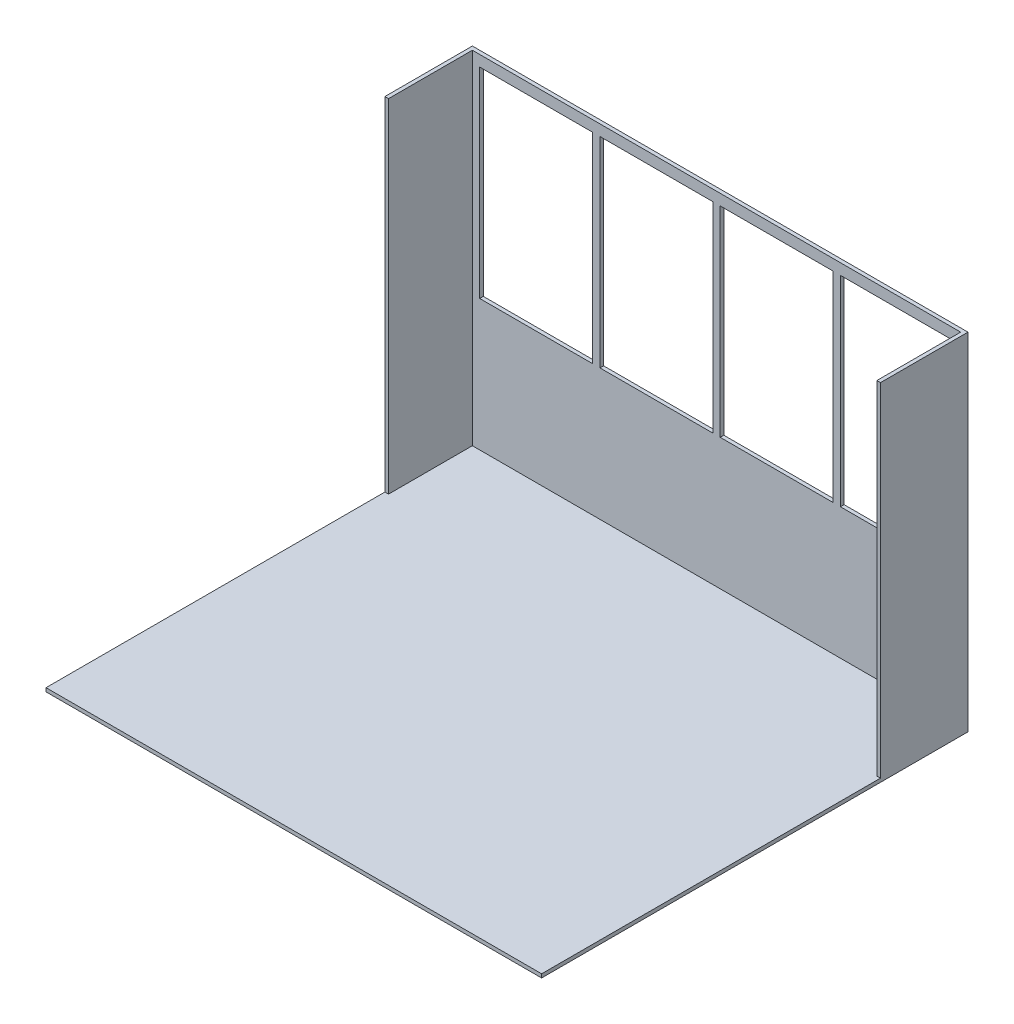
ISO-10303-21;
HEADER;
FILE_DESCRIPTION(('STEP AP214'),'2;1');
FILE_NAME('part.step','',(''),(''),'','','');
FILE_SCHEMA(('AUTOMOTIVE_DESIGN { 1 0 10303 214 1 1 1 1 }'));
ENDSEC;
DATA;
#1=APPLICATION_CONTEXT('core data for automotive mechanical design processes');
#2=APPLICATION_PROTOCOL_DEFINITION('international standard','automotive_design',2000,#1);
#3=PRODUCT_CONTEXT('',#1,'mechanical');
#4=PRODUCT('Part','Part','',(#3));
#5=PRODUCT_RELATED_PRODUCT_CATEGORY('part','',(#4));
#6=PRODUCT_DEFINITION_FORMATION('','',#4);
#7=PRODUCT_DEFINITION_CONTEXT('part definition',#1,'design');
#8=PRODUCT_DEFINITION('design','',#6,#7);
#9=PRODUCT_DEFINITION_SHAPE('','',#8);
#10=(LENGTH_UNIT() NAMED_UNIT(*) SI_UNIT(.MILLI.,.METRE.));
#11=(NAMED_UNIT(*) PLANE_ANGLE_UNIT() SI_UNIT($,.RADIAN.));
#12=(NAMED_UNIT(*) SI_UNIT($,.STERADIAN.) SOLID_ANGLE_UNIT());
#13=UNCERTAINTY_MEASURE_WITH_UNIT(LENGTH_MEASURE(1.E-05),#10,'distance_accuracy_value','');
#14=(GEOMETRIC_REPRESENTATION_CONTEXT(3) GLOBAL_UNCERTAINTY_ASSIGNED_CONTEXT((#13)) GLOBAL_UNIT_ASSIGNED_CONTEXT((#10,
#11,#12)) REPRESENTATION_CONTEXT('',''));
#15=CARTESIAN_POINT('',(0.,0.,0.));
#16=DIRECTION('',(0.,0.,1.));
#17=DIRECTION('',(1.,0.,0.));
#18=AXIS2_PLACEMENT_3D('',#15,#16,#17);
#19=CARTESIAN_POINT('',(-1727.2,2413.,304.8));
#20=DIRECTION('',(0.,0.,-1.));
#21=DIRECTION('',(-1.,0.,0.));
#22=AXIS2_PLACEMENT_3D('',#19,#20,#21);
#23=PLANE('',#22);
#24=DIRECTION('',(-1.,0.,0.));
#25=VECTOR('',#24,1.);
#26=CARTESIAN_POINT('',(-1727.2,25.4,304.8));
#27=LINE('',#26,#25);
#28=CARTESIAN_POINT('',(1727.2,25.3999999999999,304.8));
#29=VERTEX_POINT('',#28);
#30=CARTESIAN_POINT('',(1701.8,25.4,304.8));
#31=VERTEX_POINT('',#30);
#32=EDGE_CURVE('E43',#29,#31,#27,.T.);
#33=ORIENTED_EDGE('',*,*,#32,.F.);
#34=DIRECTION('',(0.,-1.,0.));
#35=VECTOR('',#34,1.);
#36=CARTESIAN_POINT('',(1727.2,2413.,304.8));
#37=LINE('',#36,#35);
#38=CARTESIAN_POINT('',(1727.2,2413.,304.8));
#39=VERTEX_POINT('',#38);
#40=EDGE_CURVE('E399',#39,#29,#37,.T.);
#41=ORIENTED_EDGE('',*,*,#40,.F.);
#42=DIRECTION('',(1.,0.,0.));
#43=VECTOR('',#42,1.);
#44=CARTESIAN_POINT('',(-1727.2,2413.,304.8));
#45=LINE('',#44,#43);
#46=CARTESIAN_POINT('',(1701.8,2413.,304.8));
#47=VERTEX_POINT('',#46);
#48=EDGE_CURVE('E395',#47,#39,#45,.T.);
#49=ORIENTED_EDGE('',*,*,#48,.F.);
#50=DIRECTION('',(0.,-1.,0.));
#51=VECTOR('',#50,1.);
#52=CARTESIAN_POINT('',(1701.8,2413.,304.8));
#53=LINE('',#52,#51);
#54=EDGE_CURVE('E382',#47,#31,#53,.T.);
#55=ORIENTED_EDGE('',*,*,#54,.T.);
#56=EDGE_LOOP('',(#33,#41,#49,#55));
#57=FACE_BOUND('',#56,.T.);
#58=ADVANCED_FACE('F33',(#57),#23,.F.);
#59=CARTESIAN_POINT('',(-1701.8,25.4,304.8));
#60=VERTEX_POINT('',#59);
#61=CARTESIAN_POINT('',(-1727.2,25.4,304.8));
#62=VERTEX_POINT('',#61);
#63=EDGE_CURVE('E11',#60,#62,#27,.T.);
#64=ORIENTED_EDGE('',*,*,#63,.F.);
#65=DIRECTION('',(0.,-1.,0.));
#66=VECTOR('',#65,1.);
#67=CARTESIAN_POINT('',(-1701.8,2413.,304.8));
#68=LINE('',#67,#66);
#69=CARTESIAN_POINT('',(-1701.8,2413.,304.8));
#70=VERTEX_POINT('',#69);
#71=EDGE_CURVE('E372',#70,#60,#68,.T.);
#72=ORIENTED_EDGE('',*,*,#71,.F.);
#73=CARTESIAN_POINT('',(-1727.2,2413.,304.8));
#74=VERTEX_POINT('',#73);
#75=EDGE_CURVE('E396',#74,#70,#45,.T.);
#76=ORIENTED_EDGE('',*,*,#75,.F.);
#77=DIRECTION('',(0.,-1.,0.));
#78=VECTOR('',#77,1.);
#79=CARTESIAN_POINT('',(-1727.2,2413.,304.8));
#80=LINE('',#79,#78);
#81=EDGE_CURVE('E407',#74,#62,#80,.T.);
#82=ORIENTED_EDGE('',*,*,#81,.T.);
#83=EDGE_LOOP('',(#64,#72,#76,#82));
#84=FACE_BOUND('',#83,.T.);
#85=ADVANCED_FACE('F437',(#84),#23,.F.);
#86=CARTESIAN_POINT('',(0.,2413.,0.));
#87=DIRECTION('',(0.,-1.,0.));
#88=DIRECTION('',(0.,0.,-1.));
#89=AXIS2_PLACEMENT_3D('',#86,#87,#88);
#90=PLANE('',#89);
#91=DIRECTION('',(0.,0.,-1.));
#92=VECTOR('',#91,1.);
#93=CARTESIAN_POINT('',(1701.8,2413.,0.));
#94=LINE('',#93,#92);
#95=CARTESIAN_POINT('',(1701.8,2413.,-279.4));
#96=VERTEX_POINT('',#95);
#97=EDGE_CURVE('E375',#47,#96,#94,.T.);
#98=ORIENTED_EDGE('',*,*,#97,.F.);
#99=ORIENTED_EDGE('',*,*,#48,.T.);
#100=DIRECTION('',(0.,0.,-1.));
#101=VECTOR('',#100,1.);
#102=CARTESIAN_POINT('',(1727.2,2413.,304.8));
#103=LINE('',#102,#101);
#104=CARTESIAN_POINT('',(1727.2,2413.,-304.8));
#105=VERTEX_POINT('',#104);
#106=EDGE_CURVE('E387',#39,#105,#103,.T.);
#107=ORIENTED_EDGE('',*,*,#106,.T.);
#108=DIRECTION('',(-1.,0.,0.));
#109=VECTOR('',#108,1.);
#110=CARTESIAN_POINT('',(-1727.2,2413.,-304.8));
#111=LINE('',#110,#109);
#112=CARTESIAN_POINT('',(-1727.2,2413.,-304.8));
#113=VERTEX_POINT('',#112);
#114=EDGE_CURVE('E390',#105,#113,#111,.T.);
#115=ORIENTED_EDGE('',*,*,#114,.T.);
#116=DIRECTION('',(0.,0.,1.));
#117=VECTOR('',#116,1.);
#118=CARTESIAN_POINT('',(-1727.2,2413.,304.8));
#119=LINE('',#118,#117);
#120=EDGE_CURVE('E393',#113,#74,#119,.T.);
#121=ORIENTED_EDGE('',*,*,#120,.T.);
#122=ORIENTED_EDGE('',*,*,#75,.T.);
#123=DIRECTION('',(0.,0.,1.));
#124=VECTOR('',#123,1.);
#125=CARTESIAN_POINT('',(-1701.8,2413.,0.));
#126=LINE('',#125,#124);
#127=CARTESIAN_POINT('',(-1701.8,2413.,-279.4));
#128=VERTEX_POINT('',#127);
#129=EDGE_CURVE('E380',#128,#70,#126,.T.);
#130=ORIENTED_EDGE('',*,*,#129,.F.);
#131=DIRECTION('',(-1.,0.,0.));
#132=VECTOR('',#131,1.);
#133=CARTESIAN_POINT('',(0.,2413.,-279.4));
#134=LINE('',#133,#132);
#135=EDGE_CURVE('E377',#96,#128,#134,.T.);
#136=ORIENTED_EDGE('',*,*,#135,.F.);
#137=EDGE_LOOP('',(#98,#99,#107,#115,#121,#122,#130,#136));
#138=FACE_BOUND('',#137,.T.);
#139=ADVANCED_FACE('F441',(#138),#90,.F.);
#140=CARTESIAN_POINT('',(1727.2,2413.,304.8));
#141=DIRECTION('',(-1.,0.,0.));
#142=DIRECTION('',(0.,0.,1.));
#143=AXIS2_PLACEMENT_3D('',#140,#141,#142);
#144=PLANE('',#143);
#145=DIRECTION('',(0.,0.,-1.));
#146=VECTOR('',#145,1.);
#147=CARTESIAN_POINT('',(1727.2,0.,304.8));
#148=LINE('',#147,#146);
#149=CARTESIAN_POINT('',(1727.2,0.,2667.));
#150=VERTEX_POINT('',#149);
#151=CARTESIAN_POINT('',(1727.2,0.,-304.8));
#152=VERTEX_POINT('',#151);
#153=EDGE_CURVE('E366',#150,#152,#148,.T.);
#154=ORIENTED_EDGE('',*,*,#153,.T.);
#155=DIRECTION('',(0.,-1.,0.));
#156=VECTOR('',#155,1.);
#157=CARTESIAN_POINT('',(1727.2,2413.,-304.8));
#158=LINE('',#157,#156);
#159=EDGE_CURVE('E37',#105,#152,#158,.T.);
#160=ORIENTED_EDGE('',*,*,#159,.F.);
#161=ORIENTED_EDGE('',*,*,#106,.F.);
#162=ORIENTED_EDGE('',*,*,#40,.T.);
#163=DIRECTION('',(0.,0.,-1.));
#164=VECTOR('',#163,1.);
#165=CARTESIAN_POINT('',(1727.2,25.3999999999999,2667.));
#166=LINE('',#165,#164);
#167=CARTESIAN_POINT('',(1727.2,25.3999999999999,2667.));
#168=VERTEX_POINT('',#167);
#169=EDGE_CURVE('E356',#168,#29,#166,.T.);
#170=ORIENTED_EDGE('',*,*,#169,.F.);
#171=DIRECTION('',(0.,1.,0.));
#172=VECTOR('',#171,1.);
#173=CARTESIAN_POINT('',(1727.2,0.,2667.));
#174=LINE('',#173,#172);
#175=EDGE_CURVE('E348',#150,#168,#174,.T.);
#176=ORIENTED_EDGE('',*,*,#175,.F.);
#177=EDGE_LOOP('',(#154,#160,#161,#162,#170,#176));
#178=FACE_BOUND('',#177,.T.);
#179=ADVANCED_FACE('F35',(#178),#144,.F.);
#180=CARTESIAN_POINT('',(-1727.2,2413.,-304.8));
#181=DIRECTION('',(0.,0.,1.));
#182=DIRECTION('',(1.,0.,0.));
#183=AXIS2_PLACEMENT_3D('',#180,#181,#182);
#184=PLANE('',#183);
#185=DIRECTION('',(1.,0.,0.));
#186=VECTOR('',#185,1.);
#187=CARTESIAN_POINT('',(-1651.,939.8,-304.8));
#188=LINE('',#187,#186);
#189=CARTESIAN_POINT('',(-1651.,939.8,-304.8));
#190=VERTEX_POINT('',#189);
#191=CARTESIAN_POINT('',(-863.600000000001,939.8,-304.8));
#192=VERTEX_POINT('',#191);
#193=EDGE_CURVE('E220',#190,#192,#188,.T.);
#194=ORIENTED_EDGE('',*,*,#193,.T.);
#195=DIRECTION('',(0.,1.,0.));
#196=VECTOR('',#195,1.);
#197=CARTESIAN_POINT('',(-863.600000000001,2336.8,-304.8));
#198=LINE('',#197,#196);
#199=CARTESIAN_POINT('',(-863.600000000001,2336.8,-304.8));
#200=VERTEX_POINT('',#199);
#201=EDGE_CURVE('E212',#192,#200,#198,.T.);
#202=ORIENTED_EDGE('',*,*,#201,.T.);
#203=DIRECTION('',(-1.,0.,0.));
#204=VECTOR('',#203,1.);
#205=CARTESIAN_POINT('',(-863.600000000001,2336.8,-304.8));
#206=LINE('',#205,#204);
#207=CARTESIAN_POINT('',(-1651.,2336.8,-304.8));
#208=VERTEX_POINT('',#207);
#209=EDGE_CURVE('E223',#200,#208,#206,.T.);
#210=ORIENTED_EDGE('',*,*,#209,.T.);
#211=DIRECTION('',(0.,-1.,0.));
#212=VECTOR('',#211,1.);
#213=CARTESIAN_POINT('',(-1651.,2336.8,-304.8));
#214=LINE('',#213,#212);
#215=EDGE_CURVE('E50',#208,#190,#214,.T.);
#216=ORIENTED_EDGE('',*,*,#215,.T.);
#217=EDGE_LOOP('',(#194,#202,#210,#216));
#218=FACE_BOUND('',#217,.T.);
#219=DIRECTION('',(-1.,0.,0.));
#220=VECTOR('',#219,1.);
#221=CARTESIAN_POINT('',(-812.800000000001,2336.8,-304.8));
#222=LINE('',#221,#220);
#223=CARTESIAN_POINT('',(-25.4000000000009,2336.8,-304.8));
#224=VERTEX_POINT('',#223);
#225=CARTESIAN_POINT('',(-812.800000000001,2336.8,-304.8));
#226=VERTEX_POINT('',#225);
#227=EDGE_CURVE('E257',#224,#226,#222,.T.);
#228=ORIENTED_EDGE('',*,*,#227,.T.);
#229=DIRECTION('',(0.,-1.,0.));
#230=VECTOR('',#229,1.);
#231=CARTESIAN_POINT('',(-812.800000000001,2336.8,-304.8));
#232=LINE('',#231,#230);
#233=CARTESIAN_POINT('',(-812.800000000001,939.8,-304.8));
#234=VERTEX_POINT('',#233);
#235=EDGE_CURVE('E249',#226,#234,#232,.T.);
#236=ORIENTED_EDGE('',*,*,#235,.T.);
#237=DIRECTION('',(1.,0.,0.));
#238=VECTOR('',#237,1.);
#239=CARTESIAN_POINT('',(-812.800000000001,939.8,-304.8));
#240=LINE('',#239,#238);
#241=CARTESIAN_POINT('',(-25.4000000000005,939.8,-304.8));
#242=VERTEX_POINT('',#241);
#243=EDGE_CURVE('E252',#234,#242,#240,.T.);
#244=ORIENTED_EDGE('',*,*,#243,.T.);
#245=DIRECTION('',(0.,1.,0.));
#246=VECTOR('',#245,1.);
#247=CARTESIAN_POINT('',(-25.4000000000009,2336.8,-304.8));
#248=LINE('',#247,#246);
#249=EDGE_CURVE('E58',#242,#224,#248,.T.);
#250=ORIENTED_EDGE('',*,*,#249,.T.);
#251=EDGE_LOOP('',(#228,#236,#244,#250));
#252=FACE_BOUND('',#251,.T.);
#253=DIRECTION('',(-1.,0.,0.));
#254=VECTOR('',#253,1.);
#255=CARTESIAN_POINT('',(25.3999999999991,2336.8,-304.8));
#256=LINE('',#255,#254);
#257=CARTESIAN_POINT('',(812.799999999999,2336.8,-304.8));
#258=VERTEX_POINT('',#257);
#259=CARTESIAN_POINT('',(25.3999999999991,2336.8,-304.8));
#260=VERTEX_POINT('',#259);
#261=EDGE_CURVE('E289',#258,#260,#256,.T.);
#262=ORIENTED_EDGE('',*,*,#261,.T.);
#263=DIRECTION('',(0.,-1.,0.));
#264=VECTOR('',#263,1.);
#265=CARTESIAN_POINT('',(25.3999999999991,939.8,-304.8));
#266=LINE('',#265,#264);
#267=CARTESIAN_POINT('',(25.3999999999991,939.8,-304.8));
#268=VERTEX_POINT('',#267);
#269=EDGE_CURVE('E279',#260,#268,#266,.T.);
#270=ORIENTED_EDGE('',*,*,#269,.T.);
#271=DIRECTION('',(1.,0.,0.));
#272=VECTOR('',#271,1.);
#273=CARTESIAN_POINT('',(25.3999999999991,939.8,-304.8));
#274=LINE('',#273,#272);
#275=CARTESIAN_POINT('',(812.799999999999,939.8,-304.8));
#276=VERTEX_POINT('',#275);
#277=EDGE_CURVE('E282',#268,#276,#274,.T.);
#278=ORIENTED_EDGE('',*,*,#277,.T.);
#279=DIRECTION('',(0.,1.,0.));
#280=VECTOR('',#279,1.);
#281=CARTESIAN_POINT('',(812.799999999999,939.8,-304.8));
#282=LINE('',#281,#280);
#283=EDGE_CURVE('E286',#276,#258,#282,.T.);
#284=ORIENTED_EDGE('',*,*,#283,.T.);
#285=EDGE_LOOP('',(#262,#270,#278,#284));
#286=FACE_BOUND('',#285,.T.);
#287=DIRECTION('',(-1.,0.,0.));
#288=VECTOR('',#287,1.);
#289=CARTESIAN_POINT('',(863.599999999999,2336.8,-304.8));
#290=LINE('',#289,#288);
#291=CARTESIAN_POINT('',(1651.,2336.8,-304.8));
#292=VERTEX_POINT('',#291);
#293=CARTESIAN_POINT('',(863.599999999999,2336.8,-304.8));
#294=VERTEX_POINT('',#293);
#295=EDGE_CURVE('E321',#292,#294,#290,.T.);
#296=ORIENTED_EDGE('',*,*,#295,.T.);
#297=DIRECTION('',(0.,-1.,0.));
#298=VECTOR('',#297,1.);
#299=CARTESIAN_POINT('',(863.599999999999,2336.8,-304.8));
#300=LINE('',#299,#298);
#301=CARTESIAN_POINT('',(863.599999999999,939.8,-304.8));
#302=VERTEX_POINT('',#301);
#303=EDGE_CURVE('E311',#294,#302,#300,.T.);
#304=ORIENTED_EDGE('',*,*,#303,.T.);
#305=DIRECTION('',(1.,0.,0.));
#306=VECTOR('',#305,1.);
#307=CARTESIAN_POINT('',(863.599999999999,939.8,-304.8));
#308=LINE('',#307,#306);
#309=CARTESIAN_POINT('',(1651.,939.799999999999,-304.8));
#310=VERTEX_POINT('',#309);
#311=EDGE_CURVE('E314',#302,#310,#308,.T.);
#312=ORIENTED_EDGE('',*,*,#311,.T.);
#313=DIRECTION('',(0.,1.,0.));
#314=VECTOR('',#313,1.);
#315=CARTESIAN_POINT('',(1651.,2336.8,-304.8));
#316=LINE('',#315,#314);
#317=EDGE_CURVE('E318',#310,#292,#316,.T.);
#318=ORIENTED_EDGE('',*,*,#317,.T.);
#319=EDGE_LOOP('',(#296,#304,#312,#318));
#320=FACE_BOUND('',#319,.T.);
#321=DIRECTION('',(-1.,0.,0.));
#322=VECTOR('',#321,1.);
#323=CARTESIAN_POINT('',(-1727.2,0.,-304.8));
#324=LINE('',#323,#322);
#325=CARTESIAN_POINT('',(-1727.2,0.,-304.8));
#326=VERTEX_POINT('',#325);
#327=EDGE_CURVE('E402',#152,#326,#324,.T.);
#328=ORIENTED_EDGE('',*,*,#327,.T.);
#329=DIRECTION('',(0.,-1.,0.));
#330=VECTOR('',#329,1.);
#331=CARTESIAN_POINT('',(-1727.2,2413.,-304.8));
#332=LINE('',#331,#330);
#333=EDGE_CURVE('E408',#113,#326,#332,.T.);
#334=ORIENTED_EDGE('',*,*,#333,.F.);
#335=ORIENTED_EDGE('',*,*,#114,.F.);
#336=ORIENTED_EDGE('',*,*,#159,.T.);
#337=EDGE_LOOP('',(#328,#334,#335,#336));
#338=FACE_BOUND('',#337,.T.);
#339=ADVANCED_FACE('F227',(#218,#252,#286,#320,#338),#184,.F.);
#340=CARTESIAN_POINT('',(-1727.2,2413.,304.8));
#341=DIRECTION('',(1.,0.,0.));
#342=DIRECTION('',(0.,0.,-1.));
#343=AXIS2_PLACEMENT_3D('',#340,#341,#342);
#344=PLANE('',#343);
#345=DIRECTION('',(0.,0.,1.));
#346=VECTOR('',#345,1.);
#347=CARTESIAN_POINT('',(-1727.2,0.,304.8));
#348=LINE('',#347,#346);
#349=CARTESIAN_POINT('',(-1727.2,0.,2667.));
#350=VERTEX_POINT('',#349);
#351=EDGE_CURVE('E391',#326,#350,#348,.T.);
#352=ORIENTED_EDGE('',*,*,#351,.T.);
#353=DIRECTION('',(0.,-1.,0.));
#354=VECTOR('',#353,1.);
#355=CARTESIAN_POINT('',(-1727.2,0.,2667.));
#356=LINE('',#355,#354);
#357=CARTESIAN_POINT('',(-1727.2,25.4,2667.));
#358=VERTEX_POINT('',#357);
#359=EDGE_CURVE('E342',#358,#350,#356,.T.);
#360=ORIENTED_EDGE('',*,*,#359,.F.);
#361=DIRECTION('',(0.,0.,-1.));
#362=VECTOR('',#361,1.);
#363=CARTESIAN_POINT('',(-1727.2,25.4,2667.));
#364=LINE('',#363,#362);
#365=EDGE_CURVE('E351',#358,#62,#364,.T.);
#366=ORIENTED_EDGE('',*,*,#365,.T.);
#367=ORIENTED_EDGE('',*,*,#81,.F.);
#368=ORIENTED_EDGE('',*,*,#120,.F.);
#369=ORIENTED_EDGE('',*,*,#333,.T.);
#370=EDGE_LOOP('',(#352,#360,#366,#367,#368,#369));
#371=FACE_BOUND('',#370,.T.);
#372=ADVANCED_FACE('F429',(#371),#344,.F.);
#373=CARTESIAN_POINT('',(0.,0.,0.));
#374=DIRECTION('',(0.,-1.,0.));
#375=DIRECTION('',(0.,0.,-1.));
#376=AXIS2_PLACEMENT_3D('',#373,#374,#375);
#377=PLANE('',#376);
#378=ORIENTED_EDGE('',*,*,#153,.F.);
#379=DIRECTION('',(1.,0.,0.));
#380=VECTOR('',#379,1.);
#381=CARTESIAN_POINT('',(-1727.2,0.,2667.));
#382=LINE('',#381,#380);
#383=EDGE_CURVE('E345',#350,#150,#382,.T.);
#384=ORIENTED_EDGE('',*,*,#383,.F.);
#385=ORIENTED_EDGE('',*,*,#351,.F.);
#386=ORIENTED_EDGE('',*,*,#327,.F.);
#387=EDGE_LOOP('',(#378,#384,#385,#386));
#388=FACE_BOUND('',#387,.T.);
#389=ADVANCED_FACE('F423',(#388),#377,.T.);
#390=CARTESIAN_POINT('',(1701.8,2413.,304.8));
#391=DIRECTION('',(-1.,0.,0.));
#392=DIRECTION('',(0.,0.,1.));
#393=AXIS2_PLACEMENT_3D('',#390,#391,#392);
#394=PLANE('',#393);
#395=DIRECTION('',(0.,0.,-1.));
#396=VECTOR('',#395,1.);
#397=CARTESIAN_POINT('',(1701.8,25.4,0.));
#398=LINE('',#397,#396);
#399=CARTESIAN_POINT('',(1701.8,25.4,-279.4));
#400=VERTEX_POINT('',#399);
#401=EDGE_CURVE('E359',#31,#400,#398,.T.);
#402=ORIENTED_EDGE('',*,*,#401,.F.);
#403=ORIENTED_EDGE('',*,*,#54,.F.);
#404=ORIENTED_EDGE('',*,*,#97,.T.);
#405=DIRECTION('',(0.,-1.,0.));
#406=VECTOR('',#405,1.);
#407=CARTESIAN_POINT('',(1701.8,2413.,-279.4));
#408=LINE('',#407,#406);
#409=EDGE_CURVE('E363',#96,#400,#408,.T.);
#410=ORIENTED_EDGE('',*,*,#409,.T.);
#411=EDGE_LOOP('',(#402,#403,#404,#410));
#412=FACE_BOUND('',#411,.T.);
#413=ADVANCED_FACE('F447',(#412),#394,.T.);
#414=CARTESIAN_POINT('',(-1727.2,2413.,-279.4));
#415=DIRECTION('',(0.,0.,1.));
#416=DIRECTION('',(1.,0.,0.));
#417=AXIS2_PLACEMENT_3D('',#414,#415,#416);
#418=PLANE('',#417);
#419=DIRECTION('',(0.,1.,0.));
#420=VECTOR('',#419,1.);
#421=CARTESIAN_POINT('',(-863.600000000001,2336.8,-279.4));
#422=LINE('',#421,#420);
#423=CARTESIAN_POINT('',(-863.600000000001,939.8,-279.4));
#424=VERTEX_POINT('',#423);
#425=CARTESIAN_POINT('',(-863.600000000001,2336.8,-279.4));
#426=VERTEX_POINT('',#425);
#427=EDGE_CURVE('E215',#424,#426,#422,.T.);
#428=ORIENTED_EDGE('',*,*,#427,.F.);
#429=DIRECTION('',(1.,0.,0.));
#430=VECTOR('',#429,1.);
#431=CARTESIAN_POINT('',(-1651.,939.8,-279.4));
#432=LINE('',#431,#430);
#433=CARTESIAN_POINT('',(-1651.,939.8,-279.4));
#434=VERTEX_POINT('',#433);
#435=EDGE_CURVE('E230',#434,#424,#432,.T.);
#436=ORIENTED_EDGE('',*,*,#435,.F.);
#437=DIRECTION('',(0.,-1.,0.));
#438=VECTOR('',#437,1.);
#439=CARTESIAN_POINT('',(-1651.,2336.8,-279.4));
#440=LINE('',#439,#438);
#441=CARTESIAN_POINT('',(-1651.,2336.8,-279.4));
#442=VERTEX_POINT('',#441);
#443=EDGE_CURVE('E233',#442,#434,#440,.T.);
#444=ORIENTED_EDGE('',*,*,#443,.F.);
#445=DIRECTION('',(-1.,0.,0.));
#446=VECTOR('',#445,1.);
#447=CARTESIAN_POINT('',(-863.600000000001,2336.8,-279.4));
#448=LINE('',#447,#446);
#449=EDGE_CURVE('E239',#426,#442,#448,.T.);
#450=ORIENTED_EDGE('',*,*,#449,.F.);
#451=EDGE_LOOP('',(#428,#436,#444,#450));
#452=FACE_BOUND('',#451,.T.);
#453=DIRECTION('',(0.,-1.,0.));
#454=VECTOR('',#453,1.);
#455=CARTESIAN_POINT('',(-812.800000000001,2336.8,-279.4));
#456=LINE('',#455,#454);
#457=CARTESIAN_POINT('',(-812.800000000001,2336.8,-279.4));
#458=VERTEX_POINT('',#457);
#459=CARTESIAN_POINT('',(-812.800000000001,939.8,-279.4));
#460=VERTEX_POINT('',#459);
#461=EDGE_CURVE('E261',#458,#460,#456,.T.);
#462=ORIENTED_EDGE('',*,*,#461,.F.);
#463=DIRECTION('',(-1.,0.,0.));
#464=VECTOR('',#463,1.);
#465=CARTESIAN_POINT('',(-812.800000000001,2336.8,-279.4));
#466=LINE('',#465,#464);
#467=CARTESIAN_POINT('',(-25.4000000000009,2336.8,-279.4));
#468=VERTEX_POINT('',#467);
#469=EDGE_CURVE('E253',#468,#458,#466,.T.);
#470=ORIENTED_EDGE('',*,*,#469,.F.);
#471=DIRECTION('',(0.,1.,0.));
#472=VECTOR('',#471,1.);
#473=CARTESIAN_POINT('',(-25.4000000000009,2336.8,-279.4));
#474=LINE('',#473,#472);
#475=CARTESIAN_POINT('',(-25.4000000000007,939.8,-279.4));
#476=VERTEX_POINT('',#475);
#477=EDGE_CURVE('E267',#476,#468,#474,.T.);
#478=ORIENTED_EDGE('',*,*,#477,.F.);
#479=DIRECTION('',(1.,0.,0.));
#480=VECTOR('',#479,1.);
#481=CARTESIAN_POINT('',(-812.800000000001,939.8,-279.4));
#482=LINE('',#481,#480);
#483=EDGE_CURVE('E263',#460,#476,#482,.T.);
#484=ORIENTED_EDGE('',*,*,#483,.F.);
#485=EDGE_LOOP('',(#462,#470,#478,#484));
#486=FACE_BOUND('',#485,.T.);
#487=DIRECTION('',(0.,-1.,0.));
#488=VECTOR('',#487,1.);
#489=CARTESIAN_POINT('',(25.3999999999991,939.8,-279.4));
#490=LINE('',#489,#488);
#491=CARTESIAN_POINT('',(25.3999999999991,2336.8,-279.4));
#492=VERTEX_POINT('',#491);
#493=CARTESIAN_POINT('',(25.399999999999,939.8,-279.4));
#494=VERTEX_POINT('',#493);
#495=EDGE_CURVE('E293',#492,#494,#490,.T.);
#496=ORIENTED_EDGE('',*,*,#495,.F.);
#497=DIRECTION('',(-1.,0.,0.));
#498=VECTOR('',#497,1.);
#499=CARTESIAN_POINT('',(25.3999999999991,2336.8,-279.4));
#500=LINE('',#499,#498);
#501=CARTESIAN_POINT('',(812.799999999999,2336.8,-279.4));
#502=VERTEX_POINT('',#501);
#503=EDGE_CURVE('E283',#502,#492,#500,.T.);
#504=ORIENTED_EDGE('',*,*,#503,.F.);
#505=DIRECTION('',(0.,1.,0.));
#506=VECTOR('',#505,1.);
#507=CARTESIAN_POINT('',(812.799999999999,939.8,-279.4));
#508=LINE('',#507,#506);
#509=CARTESIAN_POINT('',(812.799999999999,939.8,-279.4));
#510=VERTEX_POINT('',#509);
#511=EDGE_CURVE('E299',#510,#502,#508,.T.);
#512=ORIENTED_EDGE('',*,*,#511,.F.);
#513=DIRECTION('',(1.,0.,0.));
#514=VECTOR('',#513,1.);
#515=CARTESIAN_POINT('',(25.3999999999991,939.8,-279.4));
#516=LINE('',#515,#514);
#517=EDGE_CURVE('E295',#494,#510,#516,.T.);
#518=ORIENTED_EDGE('',*,*,#517,.F.);
#519=EDGE_LOOP('',(#496,#504,#512,#518));
#520=FACE_BOUND('',#519,.T.);
#521=DIRECTION('',(0.,-1.,0.));
#522=VECTOR('',#521,1.);
#523=CARTESIAN_POINT('',(863.599999999999,2336.8,-279.4));
#524=LINE('',#523,#522);
#525=CARTESIAN_POINT('',(863.599999999999,2336.8,-279.4));
#526=VERTEX_POINT('',#525);
#527=CARTESIAN_POINT('',(863.599999999999,939.799999999999,-279.4));
#528=VERTEX_POINT('',#527);
#529=EDGE_CURVE('E325',#526,#528,#524,.T.);
#530=ORIENTED_EDGE('',*,*,#529,.F.);
#531=DIRECTION('',(-1.,0.,0.));
#532=VECTOR('',#531,1.);
#533=CARTESIAN_POINT('',(863.599999999999,2336.8,-279.4));
#534=LINE('',#533,#532);
#535=CARTESIAN_POINT('',(1651.,2336.8,-279.4));
#536=VERTEX_POINT('',#535);
#537=EDGE_CURVE('E315',#536,#526,#534,.T.);
#538=ORIENTED_EDGE('',*,*,#537,.F.);
#539=DIRECTION('',(0.,1.,0.));
#540=VECTOR('',#539,1.);
#541=CARTESIAN_POINT('',(1651.,2336.8,-279.4));
#542=LINE('',#541,#540);
#543=CARTESIAN_POINT('',(1651.,939.8,-279.4));
#544=VERTEX_POINT('',#543);
#545=EDGE_CURVE('E330',#544,#536,#542,.T.);
#546=ORIENTED_EDGE('',*,*,#545,.F.);
#547=DIRECTION('',(1.,0.,0.));
#548=VECTOR('',#547,1.);
#549=CARTESIAN_POINT('',(863.599999999999,939.8,-279.4));
#550=LINE('',#549,#548);
#551=EDGE_CURVE('E327',#528,#544,#550,.T.);
#552=ORIENTED_EDGE('',*,*,#551,.F.);
#553=EDGE_LOOP('',(#530,#538,#546,#552));
#554=FACE_BOUND('',#553,.T.);
#555=DIRECTION('',(-1.,0.,0.));
#556=VECTOR('',#555,1.);
#557=CARTESIAN_POINT('',(0.,25.4,-279.4));
#558=LINE('',#557,#556);
#559=CARTESIAN_POINT('',(-1701.8,25.4,-279.4));
#560=VERTEX_POINT('',#559);
#561=EDGE_CURVE('E362',#400,#560,#558,.T.);
#562=ORIENTED_EDGE('',*,*,#561,.F.);
#563=ORIENTED_EDGE('',*,*,#409,.F.);
#564=ORIENTED_EDGE('',*,*,#135,.T.);
#565=DIRECTION('',(0.,-1.,0.));
#566=VECTOR('',#565,1.);
#567=CARTESIAN_POINT('',(-1701.8,2413.,-279.4));
#568=LINE('',#567,#566);
#569=EDGE_CURVE('E367',#128,#560,#568,.T.);
#570=ORIENTED_EDGE('',*,*,#569,.T.);
#571=EDGE_LOOP('',(#562,#563,#564,#570));
#572=FACE_BOUND('',#571,.T.);
#573=ADVANCED_FACE('F450',(#452,#486,#520,#554,#572),#418,.T.);
#574=CARTESIAN_POINT('',(-1701.8,2413.,304.8));
#575=DIRECTION('',(1.,0.,0.));
#576=DIRECTION('',(0.,0.,-1.));
#577=AXIS2_PLACEMENT_3D('',#574,#575,#576);
#578=PLANE('',#577);
#579=DIRECTION('',(0.,0.,1.));
#580=VECTOR('',#579,1.);
#581=CARTESIAN_POINT('',(-1701.8,25.4,0.));
#582=LINE('',#581,#580);
#583=EDGE_CURVE('E369',#560,#60,#582,.T.);
#584=ORIENTED_EDGE('',*,*,#583,.F.);
#585=ORIENTED_EDGE('',*,*,#569,.F.);
#586=ORIENTED_EDGE('',*,*,#129,.T.);
#587=ORIENTED_EDGE('',*,*,#71,.T.);
#588=EDGE_LOOP('',(#584,#585,#586,#587));
#589=FACE_BOUND('',#588,.T.);
#590=ADVANCED_FACE('F452',(#589),#578,.T.);
#591=CARTESIAN_POINT('',(0.,25.4,0.));
#592=DIRECTION('',(0.,-1.,0.));
#593=DIRECTION('',(0.,0.,-1.));
#594=AXIS2_PLACEMENT_3D('',#591,#592,#593);
#595=PLANE('',#594);
#596=ORIENTED_EDGE('',*,*,#401,.T.);
#597=ORIENTED_EDGE('',*,*,#561,.T.);
#598=ORIENTED_EDGE('',*,*,#583,.T.);
#599=ORIENTED_EDGE('',*,*,#63,.T.);
#600=ORIENTED_EDGE('',*,*,#365,.F.);
#601=DIRECTION('',(-1.,0.,0.));
#602=VECTOR('',#601,1.);
#603=CARTESIAN_POINT('',(-1727.2,25.4,2667.));
#604=LINE('',#603,#602);
#605=EDGE_CURVE('E350',#168,#358,#604,.T.);
#606=ORIENTED_EDGE('',*,*,#605,.F.);
#607=ORIENTED_EDGE('',*,*,#169,.T.);
#608=ORIENTED_EDGE('',*,*,#32,.T.);
#609=EDGE_LOOP('',(#596,#597,#598,#599,#600,#606,#607,#608));
#610=FACE_BOUND('',#609,.T.);
#611=ADVANCED_FACE('F433',(#610),#595,.F.);
#612=CARTESIAN_POINT('',(0.,0.,2667.));
#613=DIRECTION('',(0.,0.,-1.));
#614=DIRECTION('',(-1.,0.,0.));
#615=AXIS2_PLACEMENT_3D('',#612,#613,#614);
#616=PLANE('',#615);
#617=ORIENTED_EDGE('',*,*,#359,.T.);
#618=ORIENTED_EDGE('',*,*,#383,.T.);
#619=ORIENTED_EDGE('',*,*,#175,.T.);
#620=ORIENTED_EDGE('',*,*,#605,.T.);
#621=EDGE_LOOP('',(#617,#618,#619,#620));
#622=FACE_BOUND('',#621,.T.);
#623=ADVANCED_FACE('F425',(#622),#616,.F.);
#624=CARTESIAN_POINT('',(863.599999999999,2336.8,-304.8));
#625=DIRECTION('',(-1.,0.,0.));
#626=DIRECTION('',(0.,-1.,0.));
#627=AXIS2_PLACEMENT_3D('',#624,#625,#626);
#628=PLANE('',#627);
#629=ORIENTED_EDGE('',*,*,#529,.T.);
#630=DIRECTION('',(0.,0.,1.));
#631=VECTOR('',#630,1.);
#632=CARTESIAN_POINT('',(863.599999999999,939.8,-304.8));
#633=LINE('',#632,#631);
#634=EDGE_CURVE('E324',#302,#528,#633,.T.);
#635=ORIENTED_EDGE('',*,*,#634,.F.);
#636=ORIENTED_EDGE('',*,*,#303,.F.);
#637=DIRECTION('',(0.,0.,1.));
#638=VECTOR('',#637,1.);
#639=CARTESIAN_POINT('',(863.599999999999,2336.8,-304.8));
#640=LINE('',#639,#638);
#641=EDGE_CURVE('E296',#294,#526,#640,.T.);
#642=ORIENTED_EDGE('',*,*,#641,.T.);
#643=EDGE_LOOP('',(#629,#635,#636,#642));
#644=FACE_BOUND('',#643,.T.);
#645=ADVANCED_FACE('F534',(#644),#628,.F.);
#646=CARTESIAN_POINT('',(863.599999999999,2336.8,-304.8));
#647=DIRECTION('',(0.,1.,0.));
#648=DIRECTION('',(0.,0.,1.));
#649=AXIS2_PLACEMENT_3D('',#646,#647,#648);
#650=PLANE('',#649);
#651=ORIENTED_EDGE('',*,*,#537,.T.);
#652=ORIENTED_EDGE('',*,*,#641,.F.);
#653=ORIENTED_EDGE('',*,*,#295,.F.);
#654=DIRECTION('',(0.,0.,1.));
#655=VECTOR('',#654,1.);
#656=CARTESIAN_POINT('',(1651.,2336.8,-304.8));
#657=LINE('',#656,#655);
#658=EDGE_CURVE('E336',#292,#536,#657,.T.);
#659=ORIENTED_EDGE('',*,*,#658,.T.);
#660=EDGE_LOOP('',(#651,#652,#653,#659));
#661=FACE_BOUND('',#660,.T.);
#662=ADVANCED_FACE('F553',(#661),#650,.F.);
#663=CARTESIAN_POINT('',(1651.,2336.8,-304.8));
#664=DIRECTION('',(1.,0.,0.));
#665=DIRECTION('',(0.,1.,0.));
#666=AXIS2_PLACEMENT_3D('',#663,#664,#665);
#667=PLANE('',#666);
#668=ORIENTED_EDGE('',*,*,#545,.T.);
#669=ORIENTED_EDGE('',*,*,#658,.F.);
#670=ORIENTED_EDGE('',*,*,#317,.F.);
#671=DIRECTION('',(0.,0.,1.));
#672=VECTOR('',#671,1.);
#673=CARTESIAN_POINT('',(1651.,939.8,-304.8));
#674=LINE('',#673,#672);
#675=EDGE_CURVE('E338',#310,#544,#674,.T.);
#676=ORIENTED_EDGE('',*,*,#675,.T.);
#677=EDGE_LOOP('',(#668,#669,#670,#676));
#678=FACE_BOUND('',#677,.T.);
#679=ADVANCED_FACE('F563',(#678),#667,.F.);
#680=CARTESIAN_POINT('',(863.599999999999,939.8,-304.8));
#681=DIRECTION('',(0.,-1.,0.));
#682=DIRECTION('',(1.,0.,0.));
#683=AXIS2_PLACEMENT_3D('',#680,#681,#682);
#684=PLANE('',#683);
#685=ORIENTED_EDGE('',*,*,#551,.T.);
#686=ORIENTED_EDGE('',*,*,#675,.F.);
#687=ORIENTED_EDGE('',*,*,#311,.F.);
#688=ORIENTED_EDGE('',*,*,#634,.T.);
#689=EDGE_LOOP('',(#685,#686,#687,#688));
#690=FACE_BOUND('',#689,.T.);
#691=ADVANCED_FACE('F573',(#690),#684,.F.);
#692=CARTESIAN_POINT('',(25.3999999999991,939.8,-304.8));
#693=DIRECTION('',(-1.,0.,0.));
#694=DIRECTION('',(0.,0.,1.));
#695=AXIS2_PLACEMENT_3D('',#692,#693,#694);
#696=PLANE('',#695);
#697=ORIENTED_EDGE('',*,*,#495,.T.);
#698=DIRECTION('',(0.,0.,1.));
#699=VECTOR('',#698,1.);
#700=CARTESIAN_POINT('',(25.3999999999991,939.8,-304.8));
#701=LINE('',#700,#699);
#702=EDGE_CURVE('E292',#268,#494,#701,.T.);
#703=ORIENTED_EDGE('',*,*,#702,.F.);
#704=ORIENTED_EDGE('',*,*,#269,.F.);
#705=DIRECTION('',(0.,0.,1.));
#706=VECTOR('',#705,1.);
#707=CARTESIAN_POINT('',(25.3999999999991,2336.8,-304.8));
#708=LINE('',#707,#706);
#709=EDGE_CURVE('E264',#260,#492,#708,.T.);
#710=ORIENTED_EDGE('',*,*,#709,.T.);
#711=EDGE_LOOP('',(#697,#703,#704,#710));
#712=FACE_BOUND('',#711,.T.);
#713=ADVANCED_FACE('F583',(#712),#696,.F.);
#714=CARTESIAN_POINT('',(25.3999999999991,2336.8,-304.8));
#715=DIRECTION('',(0.,1.,0.));
#716=DIRECTION('',(0.,0.,1.));
#717=AXIS2_PLACEMENT_3D('',#714,#715,#716);
#718=PLANE('',#717);
#719=ORIENTED_EDGE('',*,*,#503,.T.);
#720=ORIENTED_EDGE('',*,*,#709,.F.);
#721=ORIENTED_EDGE('',*,*,#261,.F.);
#722=DIRECTION('',(0.,0.,1.));
#723=VECTOR('',#722,1.);
#724=CARTESIAN_POINT('',(812.799999999999,2336.8,-304.8));
#725=LINE('',#724,#723);
#726=EDGE_CURVE('E305',#258,#502,#725,.T.);
#727=ORIENTED_EDGE('',*,*,#726,.T.);
#728=EDGE_LOOP('',(#719,#720,#721,#727));
#729=FACE_BOUND('',#728,.T.);
#730=ADVANCED_FACE('F593',(#729),#718,.F.);
#731=CARTESIAN_POINT('',(812.799999999999,939.8,-304.8));
#732=DIRECTION('',(1.,0.,0.));
#733=DIRECTION('',(0.,0.,-1.));
#734=AXIS2_PLACEMENT_3D('',#731,#732,#733);
#735=PLANE('',#734);
#736=ORIENTED_EDGE('',*,*,#511,.T.);
#737=ORIENTED_EDGE('',*,*,#726,.F.);
#738=ORIENTED_EDGE('',*,*,#283,.F.);
#739=DIRECTION('',(0.,0.,1.));
#740=VECTOR('',#739,1.);
#741=CARTESIAN_POINT('',(812.799999999999,939.8,-304.8));
#742=LINE('',#741,#740);
#743=EDGE_CURVE('E307',#276,#510,#742,.T.);
#744=ORIENTED_EDGE('',*,*,#743,.T.);
#745=EDGE_LOOP('',(#736,#737,#738,#744));
#746=FACE_BOUND('',#745,.T.);
#747=ADVANCED_FACE('F603',(#746),#735,.F.);
#748=CARTESIAN_POINT('',(25.3999999999991,939.8,-304.8));
#749=DIRECTION('',(0.,-1.,0.));
#750=DIRECTION('',(0.,0.,-1.));
#751=AXIS2_PLACEMENT_3D('',#748,#749,#750);
#752=PLANE('',#751);
#753=ORIENTED_EDGE('',*,*,#517,.T.);
#754=ORIENTED_EDGE('',*,*,#743,.F.);
#755=ORIENTED_EDGE('',*,*,#277,.F.);
#756=ORIENTED_EDGE('',*,*,#702,.T.);
#757=EDGE_LOOP('',(#753,#754,#755,#756));
#758=FACE_BOUND('',#757,.T.);
#759=ADVANCED_FACE('F613',(#758),#752,.F.);
#760=CARTESIAN_POINT('',(-812.800000000001,2336.8,-304.8));
#761=DIRECTION('',(-1.,0.,0.));
#762=DIRECTION('',(0.,-1.,0.));
#763=AXIS2_PLACEMENT_3D('',#760,#761,#762);
#764=PLANE('',#763);
#765=ORIENTED_EDGE('',*,*,#461,.T.);
#766=DIRECTION('',(0.,0.,1.));
#767=VECTOR('',#766,1.);
#768=CARTESIAN_POINT('',(-812.800000000001,939.8,-304.8));
#769=LINE('',#768,#767);
#770=EDGE_CURVE('E260',#234,#460,#769,.T.);
#771=ORIENTED_EDGE('',*,*,#770,.F.);
#772=ORIENTED_EDGE('',*,*,#235,.F.);
#773=DIRECTION('',(0.,0.,1.));
#774=VECTOR('',#773,1.);
#775=CARTESIAN_POINT('',(-812.800000000001,2336.8,-304.8));
#776=LINE('',#775,#774);
#777=EDGE_CURVE('E240',#226,#458,#776,.T.);
#778=ORIENTED_EDGE('',*,*,#777,.T.);
#779=EDGE_LOOP('',(#765,#771,#772,#778));
#780=FACE_BOUND('',#779,.T.);
#781=ADVANCED_FACE('F623',(#780),#764,.F.);
#782=CARTESIAN_POINT('',(-812.800000000001,2336.8,-304.8));
#783=DIRECTION('',(0.,1.,0.));
#784=DIRECTION('',(0.,0.,1.));
#785=AXIS2_PLACEMENT_3D('',#782,#783,#784);
#786=PLANE('',#785);
#787=ORIENTED_EDGE('',*,*,#469,.T.);
#788=ORIENTED_EDGE('',*,*,#777,.F.);
#789=ORIENTED_EDGE('',*,*,#227,.F.);
#790=DIRECTION('',(0.,0.,1.));
#791=VECTOR('',#790,1.);
#792=CARTESIAN_POINT('',(-25.4000000000009,2336.8,-304.8));
#793=LINE('',#792,#791);
#794=EDGE_CURVE('E273',#224,#468,#793,.T.);
#795=ORIENTED_EDGE('',*,*,#794,.T.);
#796=EDGE_LOOP('',(#787,#788,#789,#795));
#797=FACE_BOUND('',#796,.T.);
#798=ADVANCED_FACE('F633',(#797),#786,.F.);
#799=CARTESIAN_POINT('',(-25.4000000000009,2336.8,-304.8));
#800=DIRECTION('',(1.,0.,0.));
#801=DIRECTION('',(0.,1.,0.));
#802=AXIS2_PLACEMENT_3D('',#799,#800,#801);
#803=PLANE('',#802);
#804=ORIENTED_EDGE('',*,*,#477,.T.);
#805=ORIENTED_EDGE('',*,*,#794,.F.);
#806=ORIENTED_EDGE('',*,*,#249,.F.);
#807=DIRECTION('',(0.,0.,1.));
#808=VECTOR('',#807,1.);
#809=CARTESIAN_POINT('',(-25.4000000000007,939.8,-304.8));
#810=LINE('',#809,#808);
#811=EDGE_CURVE('E275',#242,#476,#810,.T.);
#812=ORIENTED_EDGE('',*,*,#811,.T.);
#813=EDGE_LOOP('',(#804,#805,#806,#812));
#814=FACE_BOUND('',#813,.T.);
#815=ADVANCED_FACE('F643',(#814),#803,.F.);
#816=CARTESIAN_POINT('',(-812.800000000001,939.8,-304.8));
#817=DIRECTION('',(0.,-1.,0.));
#818=DIRECTION('',(1.,0.,0.));
#819=AXIS2_PLACEMENT_3D('',#816,#817,#818);
#820=PLANE('',#819);
#821=ORIENTED_EDGE('',*,*,#483,.T.);
#822=ORIENTED_EDGE('',*,*,#811,.F.);
#823=ORIENTED_EDGE('',*,*,#243,.F.);
#824=ORIENTED_EDGE('',*,*,#770,.T.);
#825=EDGE_LOOP('',(#821,#822,#823,#824));
#826=FACE_BOUND('',#825,.T.);
#827=ADVANCED_FACE('F653',(#826),#820,.F.);
#828=CARTESIAN_POINT('',(-863.600000000001,2336.8,-304.8));
#829=DIRECTION('',(1.,0.,0.));
#830=DIRECTION('',(0.,1.,0.));
#831=AXIS2_PLACEMENT_3D('',#828,#829,#830);
#832=PLANE('',#831);
#833=ORIENTED_EDGE('',*,*,#427,.T.);
#834=DIRECTION('',(0.,0.,1.));
#835=VECTOR('',#834,1.);
#836=CARTESIAN_POINT('',(-863.600000000001,2336.8,-304.8));
#837=LINE('',#836,#835);
#838=EDGE_CURVE('E208',#200,#426,#837,.T.);
#839=ORIENTED_EDGE('',*,*,#838,.F.);
#840=ORIENTED_EDGE('',*,*,#201,.F.);
#841=DIRECTION('',(0.,0.,1.));
#842=VECTOR('',#841,1.);
#843=CARTESIAN_POINT('',(-863.600000000001,939.8,-304.8));
#844=LINE('',#843,#842);
#845=EDGE_CURVE('E244',#192,#424,#844,.T.);
#846=ORIENTED_EDGE('',*,*,#845,.T.);
#847=EDGE_LOOP('',(#833,#839,#840,#846));
#848=FACE_BOUND('',#847,.T.);
#849=ADVANCED_FACE('F210',(#848),#832,.F.);
#850=CARTESIAN_POINT('',(-1651.,939.8,-304.8));
#851=DIRECTION('',(0.,-1.,0.));
#852=DIRECTION('',(1.,0.,0.));
#853=AXIS2_PLACEMENT_3D('',#850,#851,#852);
#854=PLANE('',#853);
#855=ORIENTED_EDGE('',*,*,#435,.T.);
#856=ORIENTED_EDGE('',*,*,#845,.F.);
#857=ORIENTED_EDGE('',*,*,#193,.F.);
#858=DIRECTION('',(0.,0.,1.));
#859=VECTOR('',#858,1.);
#860=CARTESIAN_POINT('',(-1651.,939.8,-304.8));
#861=LINE('',#860,#859);
#862=EDGE_CURVE('E246',#190,#434,#861,.T.);
#863=ORIENTED_EDGE('',*,*,#862,.T.);
#864=EDGE_LOOP('',(#855,#856,#857,#863));
#865=FACE_BOUND('',#864,.T.);
#866=ADVANCED_FACE('F671',(#865),#854,.F.);
#867=CARTESIAN_POINT('',(-1651.,2336.8,-304.8));
#868=DIRECTION('',(-1.,0.,0.));
#869=DIRECTION('',(0.,0.,1.));
#870=AXIS2_PLACEMENT_3D('',#867,#868,#869);
#871=PLANE('',#870);
#872=ORIENTED_EDGE('',*,*,#443,.T.);
#873=ORIENTED_EDGE('',*,*,#862,.F.);
#874=ORIENTED_EDGE('',*,*,#215,.F.);
#875=DIRECTION('',(0.,0.,1.));
#876=VECTOR('',#875,1.);
#877=CARTESIAN_POINT('',(-1651.,2336.8,-304.8));
#878=LINE('',#877,#876);
#879=EDGE_CURVE('E219',#208,#442,#878,.T.);
#880=ORIENTED_EDGE('',*,*,#879,.T.);
#881=EDGE_LOOP('',(#872,#873,#874,#880));
#882=FACE_BOUND('',#881,.T.);
#883=ADVANCED_FACE('F680',(#882),#871,.F.);
#884=CARTESIAN_POINT('',(-863.600000000001,2336.8,-304.8));
#885=DIRECTION('',(0.,1.,0.));
#886=DIRECTION('',(0.,0.,1.));
#887=AXIS2_PLACEMENT_3D('',#884,#885,#886);
#888=PLANE('',#887);
#889=ORIENTED_EDGE('',*,*,#449,.T.);
#890=ORIENTED_EDGE('',*,*,#879,.F.);
#891=ORIENTED_EDGE('',*,*,#209,.F.);
#892=ORIENTED_EDGE('',*,*,#838,.T.);
#893=EDGE_LOOP('',(#889,#890,#891,#892));
#894=FACE_BOUND('',#893,.T.);
#895=ADVANCED_FACE('F224',(#894),#888,.F.);
#896=CLOSED_SHELL('',(#58,#85,#139,#179,#339,#372,#389,#413,#573,#590,#611,#623,#645,#662,#679,
#691,#713,#730,#747,#759,#781,#798,#815,#827,#849,#866,#883,#895));
#897=MANIFOLD_SOLID_BREP('B2',#896);
#898=ADVANCED_BREP_SHAPE_REPRESENTATION('',(#18,#897),#14);
#899=SHAPE_DEFINITION_REPRESENTATION(#9,#898);
ENDSEC;
END-ISO-10303-21;
